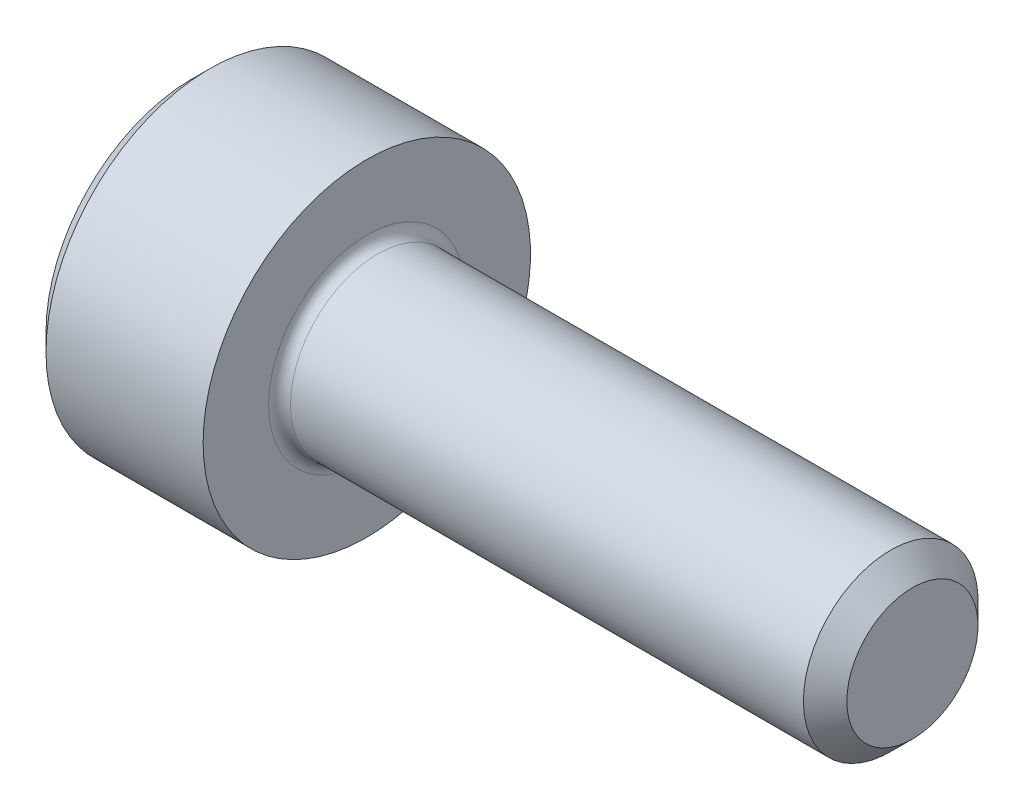
ISO-10303-21;
HEADER;
FILE_DESCRIPTION(('STEP AP214'),'2;1');
FILE_NAME('part.step','',(''),(''),'','','');
FILE_SCHEMA(('AUTOMOTIVE_DESIGN { 1 0 10303 214 1 1 1 1 }'));
ENDSEC;
DATA;
#1=APPLICATION_CONTEXT('core data for automotive mechanical design processes');
#2=APPLICATION_PROTOCOL_DEFINITION('international standard','automotive_design',2000,#1);
#3=PRODUCT_CONTEXT('',#1,'mechanical');
#4=PRODUCT('Part','Part','',(#3));
#5=PRODUCT_RELATED_PRODUCT_CATEGORY('part','',(#4));
#6=PRODUCT_DEFINITION_FORMATION('','',#4);
#7=PRODUCT_DEFINITION_CONTEXT('part definition',#1,'design');
#8=PRODUCT_DEFINITION('design','',#6,#7);
#9=PRODUCT_DEFINITION_SHAPE('','',#8);
#10=(LENGTH_UNIT() NAMED_UNIT(*) SI_UNIT(.MILLI.,.METRE.));
#11=(NAMED_UNIT(*) PLANE_ANGLE_UNIT() SI_UNIT($,.RADIAN.));
#12=(NAMED_UNIT(*) SI_UNIT($,.STERADIAN.) SOLID_ANGLE_UNIT());
#13=UNCERTAINTY_MEASURE_WITH_UNIT(LENGTH_MEASURE(1.E-05),#10,'distance_accuracy_value','');
#14=(GEOMETRIC_REPRESENTATION_CONTEXT(3) GLOBAL_UNCERTAINTY_ASSIGNED_CONTEXT((#13)) GLOBAL_UNIT_ASSIGNED_CONTEXT((#10,
#11,#12)) REPRESENTATION_CONTEXT('',''));
#15=CARTESIAN_POINT('',(0.,0.,0.));
#16=DIRECTION('',(0.,0.,1.));
#17=DIRECTION('',(1.,0.,0.));
#18=AXIS2_PLACEMENT_3D('',#15,#16,#17);
#19=CARTESIAN_POINT('',(-55.965423383529,9.55422118909155,-1.7600651401608));
#20=DIRECTION('',(-1.,0.,0.));
#21=DIRECTION('',(0.,0.,1.));
#22=AXIS2_PLACEMENT_3D('',#19,#20,#21);
#23=PLANE('',#22);
#24=DIRECTION('',(0.,-0.5,0.866025403784438));
#25=VECTOR('',#24,1.);
#26=CARTESIAN_POINT('',(-55.965423383529,10.4462273549895,-1.76006514016081));
#27=LINE('',#26,#25);
#28=CARTESIAN_POINT('',(-55.965423383529,10.4462273549895,-1.76006514016081));
#29=VERTEX_POINT('',#28);
#30=CARTESIAN_POINT('',(-55.965423383529,10.0002242720405,-0.987565140160805));
#31=VERTEX_POINT('',#30);
#32=EDGE_CURVE('E422',#29,#31,#27,.T.);
#33=ORIENTED_EDGE('',*,*,#32,.T.);
#34=DIRECTION('',(0.,1.,0.));
#35=VECTOR('',#34,1.);
#36=CARTESIAN_POINT('',(-55.965423383529,9.10821810614256,-0.987565140160804));
#37=LINE('',#36,#35);
#38=CARTESIAN_POINT('',(-55.965423383529,9.10821810614256,-0.987565140160804));
#39=VERTEX_POINT('',#38);
#40=EDGE_CURVE('E112',#39,#31,#37,.T.);
#41=ORIENTED_EDGE('',*,*,#40,.F.);
#42=DIRECTION('',(0.,-0.500000000000001,-0.866025403784438));
#43=VECTOR('',#42,1.);
#44=CARTESIAN_POINT('',(-55.965423383529,9.10821810614256,-0.987565140160804));
#45=LINE('',#44,#43);
#46=CARTESIAN_POINT('',(-55.965423383529,8.66221502319358,-1.7600651401608));
#47=VERTEX_POINT('',#46);
#48=EDGE_CURVE('E425',#39,#47,#45,.T.);
#49=ORIENTED_EDGE('',*,*,#48,.T.);
#50=DIRECTION('',(0.,0.500000000000001,-0.866025403784438));
#51=VECTOR('',#50,1.);
#52=CARTESIAN_POINT('',(-55.965423383529,8.66221502319358,-1.7600651401608));
#53=LINE('',#52,#51);
#54=CARTESIAN_POINT('',(-55.965423383529,9.10821810614256,-2.5325651401608));
#55=VERTEX_POINT('',#54);
#56=EDGE_CURVE('E428',#47,#55,#53,.T.);
#57=ORIENTED_EDGE('',*,*,#56,.T.);
#58=DIRECTION('',(0.,-1.,0.));
#59=VECTOR('',#58,1.);
#60=CARTESIAN_POINT('',(-55.965423383529,10.0002242720405,-2.5325651401608));
#61=LINE('',#60,#59);
#62=CARTESIAN_POINT('',(-55.965423383529,10.0002242720405,-2.5325651401608));
#63=VERTEX_POINT('',#62);
#64=EDGE_CURVE('E431',#63,#55,#61,.T.);
#65=ORIENTED_EDGE('',*,*,#64,.F.);
#66=DIRECTION('',(0.,-0.500000000000001,-0.866025403784438));
#67=VECTOR('',#66,1.);
#68=CARTESIAN_POINT('',(-55.965423383529,10.4462273549895,-1.76006514016081));
#69=LINE('',#68,#67);
#70=EDGE_CURVE('E107',#29,#63,#69,.T.);
#71=ORIENTED_EDGE('',*,*,#70,.F.);
#72=EDGE_LOOP('',(#33,#41,#49,#57,#65,#71));
#73=FACE_BOUND('',#72,.T.);
#74=CARTESIAN_POINT('',(-55.965423383529,9.55422118909155,-1.7600651401608));
#75=DIRECTION('',(-1.,0.,0.));
#76=DIRECTION('',(0.,0.,1.));
#77=AXIS2_PLACEMENT_3D('',#74,#75,#76);
#78=CIRCLE('',#77,1.34);
#79=CARTESIAN_POINT('',(-55.965423383529,9.55422118909155,-0.420065140160804));
#80=VERTEX_POINT('',#79);
#81=EDGE_CURVE('E123',#80,#80,#78,.T.);
#82=ORIENTED_EDGE('',*,*,#81,.T.);
#83=EDGE_LOOP('',(#82));
#84=FACE_BOUND('',#83,.T.);
#85=ADVANCED_FACE('F16',(#73,#84),#23,.T.);
#86=CARTESIAN_POINT('',(-49.365423383529,10.1552211890916,-1.7600651401608));
#87=DIRECTION('',(1.,0.,0.));
#88=DIRECTION('',(0.,0.,-1.));
#89=AXIS2_PLACEMENT_3D('',#86,#87,#88);
#90=PLANE('',#89);
#91=CARTESIAN_POINT('',(-49.365423383529,9.55422118909155,-1.7600651401608));
#92=DIRECTION('',(-1.,0.,0.));
#93=DIRECTION('',(0.,0.,1.));
#94=AXIS2_PLACEMENT_3D('',#91,#92,#93);
#95=CIRCLE('',#94,0.601);
#96=CARTESIAN_POINT('',(-49.365423383529,9.55422118909155,-1.1590651401608));
#97=VERTEX_POINT('',#96);
#98=EDGE_CURVE('E136',#97,#97,#95,.T.);
#99=ORIENTED_EDGE('',*,*,#98,.F.);
#100=EDGE_LOOP('',(#99));
#101=FACE_BOUND('',#100,.T.);
#102=ADVANCED_FACE('F158',(#101),#90,.T.);
#103=CARTESIAN_POINT('',(-49.365423383529,9.55422118909155,-1.7600651401608));
#104=DIRECTION('',(-1.,0.,0.));
#105=DIRECTION('',(0.,0.,1.));
#106=AXIS2_PLACEMENT_3D('',#103,#104,#105);
#107=CONICAL_SURFACE('',#106,0.601,0.785398163397472);
#108=CARTESIAN_POINT('',(-49.564423383529,9.55422118909155,-1.7600651401608));
#109=DIRECTION('',(-1.,0.,0.));
#110=DIRECTION('',(0.,0.,1.));
#111=AXIS2_PLACEMENT_3D('',#108,#109,#110);
#112=CIRCLE('',#111,0.8);
#113=CARTESIAN_POINT('',(-49.564423383529,9.55422118909155,-0.960065140160804));
#114=VERTEX_POINT('',#113);
#115=EDGE_CURVE('E133',#114,#114,#112,.T.);
#116=ORIENTED_EDGE('',*,*,#115,.F.);
#117=EDGE_LOOP('',(#116));
#118=FACE_BOUND('',#117,.T.);
#119=ORIENTED_EDGE('',*,*,#98,.T.);
#120=EDGE_LOOP('',(#119));
#121=FACE_BOUND('',#120,.T.);
#122=ADVANCED_FACE('F164',(#118,#121),#107,.T.);
#123=CARTESIAN_POINT('',(-87.715423383529,9.55422118909155,-1.7600651401608));
#124=DIRECTION('',(-1.,0.,0.));
#125=DIRECTION('',(0.,0.,1.));
#126=AXIS2_PLACEMENT_3D('',#123,#124,#125);
#127=CYLINDRICAL_SURFACE('',#126,0.799999999999999);
#128=CARTESIAN_POINT('',(-54.265423383529,9.55422118909155,-1.7600651401608));
#129=DIRECTION('',(1.,0.,0.));
#130=DIRECTION('',(0.,0.,-1.));
#131=AXIS2_PLACEMENT_3D('',#128,#129,#130);
#132=CIRCLE('',#131,0.799999999999999);
#133=CARTESIAN_POINT('',(-54.265423383529,9.55422118909155,-2.5600651401608));
#134=VERTEX_POINT('',#133);
#135=EDGE_CURVE('E10',#134,#134,#132,.T.);
#136=ORIENTED_EDGE('',*,*,#135,.T.);
#137=EDGE_LOOP('',(#136));
#138=FACE_BOUND('',#137,.T.);
#139=ORIENTED_EDGE('',*,*,#115,.T.);
#140=EDGE_LOOP('',(#139));
#141=FACE_BOUND('',#140,.T.);
#142=ADVANCED_FACE('F175',(#138,#141),#127,.T.);
#143=CARTESIAN_POINT('',(-54.365423383529,11.0542211890915,-1.7600651401608));
#144=DIRECTION('',(1.,0.,0.));
#145=DIRECTION('',(0.,0.,-1.));
#146=AXIS2_PLACEMENT_3D('',#143,#144,#145);
#147=PLANE('',#146);
#148=CARTESIAN_POINT('',(-54.365423383529,9.55422118909155,-1.7600651401608));
#149=DIRECTION('',(1.,0.,0.));
#150=DIRECTION('',(0.,0.,-1.));
#151=AXIS2_PLACEMENT_3D('',#148,#149,#150);
#152=CIRCLE('',#151,0.9);
#153=CARTESIAN_POINT('',(-54.365423383529,9.55422118909155,-2.6600651401608));
#154=VERTEX_POINT('',#153);
#155=EDGE_CURVE('E24',#154,#154,#152,.F.);
#156=ORIENTED_EDGE('',*,*,#155,.T.);
#157=EDGE_LOOP('',(#156));
#158=FACE_BOUND('',#157,.T.);
#159=CARTESIAN_POINT('',(-54.365423383529,9.55422118909155,-1.7600651401608));
#160=DIRECTION('',(-1.,0.,0.));
#161=DIRECTION('',(0.,0.,1.));
#162=AXIS2_PLACEMENT_3D('',#159,#160,#161);
#163=CIRCLE('',#162,1.5);
#164=CARTESIAN_POINT('',(-54.365423383529,9.55422118909155,-0.260065140160805));
#165=VERTEX_POINT('',#164);
#166=EDGE_CURVE('E130',#165,#165,#163,.T.);
#167=ORIENTED_EDGE('',*,*,#166,.F.);
#168=EDGE_LOOP('',(#167));
#169=FACE_BOUND('',#168,.T.);
#170=ADVANCED_FACE('F141',(#158,#169),#147,.T.);
#171=CARTESIAN_POINT('',(-87.715423383529,9.55422118909155,-1.7600651401608));
#172=DIRECTION('',(-1.,0.,0.));
#173=DIRECTION('',(0.,0.,1.));
#174=AXIS2_PLACEMENT_3D('',#171,#172,#173);
#175=CYLINDRICAL_SURFACE('',#174,1.5);
#176=ORIENTED_EDGE('',*,*,#166,.T.);
#177=EDGE_LOOP('',(#176));
#178=FACE_BOUND('',#177,.T.);
#179=CARTESIAN_POINT('',(-55.805423383529,9.55422118909155,-1.7600651401608));
#180=DIRECTION('',(-1.,0.,0.));
#181=DIRECTION('',(0.,0.,1.));
#182=AXIS2_PLACEMENT_3D('',#179,#180,#181);
#183=CIRCLE('',#182,1.5);
#184=CARTESIAN_POINT('',(-55.805423383529,9.55422118909155,-0.260065140160805));
#185=VERTEX_POINT('',#184);
#186=EDGE_CURVE('E127',#185,#185,#183,.T.);
#187=ORIENTED_EDGE('',*,*,#186,.F.);
#188=EDGE_LOOP('',(#187));
#189=FACE_BOUND('',#188,.T.);
#190=ADVANCED_FACE('F153',(#178,#189),#175,.T.);
#191=CARTESIAN_POINT('',(-55.965423383529,9.55422118909155,-1.7600651401608));
#192=DIRECTION('',(1.,0.,0.));
#193=DIRECTION('',(0.,0.,-1.));
#194=AXIS2_PLACEMENT_3D('',#191,#192,#193);
#195=CONICAL_SURFACE('',#194,1.34,0.785398163397443);
#196=ORIENTED_EDGE('',*,*,#186,.T.);
#197=EDGE_LOOP('',(#196));
#198=FACE_BOUND('',#197,.T.);
#199=ORIENTED_EDGE('',*,*,#81,.F.);
#200=EDGE_LOOP('',(#199));
#201=FACE_BOUND('',#200,.T.);
#202=ADVANCED_FACE('F145',(#198,#201),#195,.T.);
#203=CARTESIAN_POINT('',(-54.265423383529,9.55422118909155,-1.7600651401608));
#204=DIRECTION('',(1.,0.,0.));
#205=DIRECTION('',(0.,0.,-1.));
#206=AXIS2_PLACEMENT_3D('',#203,#204,#205);
#207=TOROIDAL_SURFACE('',#206,0.9,0.1);
#208=ORIENTED_EDGE('',*,*,#135,.F.);
#209=EDGE_LOOP('',(#208));
#210=FACE_BOUND('',#209,.T.);
#211=ORIENTED_EDGE('',*,*,#155,.F.);
#212=EDGE_LOOP('',(#211));
#213=FACE_BOUND('',#212,.T.);
#214=ADVANCED_FACE('F18',(#210,#213),#207,.F.);
#215=CARTESIAN_POINT('',(-55.265423383529,10.4462273549895,-1.76006514016081));
#216=DIRECTION('',(0.,-0.866025403784438,-0.5));
#217=DIRECTION('',(0.,0.5,-0.866025403784439));
#218=AXIS2_PLACEMENT_3D('',#215,#216,#217);
#219=PLANE('',#218);
#220=ORIENTED_EDGE('',*,*,#32,.F.);
#221=DIRECTION('',(-1.,0.,0.));
#222=VECTOR('',#221,1.);
#223=CARTESIAN_POINT('',(-55.265423383529,10.4462273549895,-1.76006514016081));
#224=LINE('',#223,#222);
#225=CARTESIAN_POINT('',(-55.265423383529,10.4462273549895,-1.76006514016081));
#226=VERTEX_POINT('',#225);
#227=EDGE_CURVE('E421',#226,#29,#224,.T.);
#228=ORIENTED_EDGE('',*,*,#227,.F.);
#229=DIRECTION('',(0.,-0.5,0.866025403784438));
#230=VECTOR('',#229,1.);
#231=CARTESIAN_POINT('',(-55.265423383529,10.4462273549895,-1.76006514016081));
#232=LINE('',#231,#230);
#233=CARTESIAN_POINT('',(-55.265423383529,10.223225813515,-1.3738151401608));
#234=VERTEX_POINT('',#233);
#235=EDGE_CURVE('E99',#226,#234,#232,.T.);
#236=ORIENTED_EDGE('',*,*,#235,.T.);
#237=CARTESIAN_POINT('',(-55.265423383529,10.0002242720405,-0.987565140160805));
#238=VERTEX_POINT('',#237);
#239=EDGE_CURVE('E90',#234,#238,#232,.T.);
#240=ORIENTED_EDGE('',*,*,#239,.T.);
#241=DIRECTION('',(-1.,0.,0.));
#242=VECTOR('',#241,1.);
#243=CARTESIAN_POINT('',(-55.265423383529,10.0002242720405,-0.987565140160805));
#244=LINE('',#243,#242);
#245=EDGE_CURVE('E104',#238,#31,#244,.T.);
#246=ORIENTED_EDGE('',*,*,#245,.T.);
#247=EDGE_LOOP('',(#220,#228,#236,#240,#246));
#248=FACE_BOUND('',#247,.T.);
#249=ADVANCED_FACE('F103',(#248),#219,.T.);
#250=CARTESIAN_POINT('',(-55.265423383529,9.10821810614256,-0.987565140160804));
#251=DIRECTION('',(0.,0.,1.));
#252=DIRECTION('',(0.,-1.,0.));
#253=AXIS2_PLACEMENT_3D('',#250,#251,#252);
#254=PLANE('',#253);
#255=ORIENTED_EDGE('',*,*,#40,.T.);
#256=ORIENTED_EDGE('',*,*,#245,.F.);
#257=DIRECTION('',(0.,1.,0.));
#258=VECTOR('',#257,1.);
#259=CARTESIAN_POINT('',(-55.265423383529,9.10821810614256,-0.987565140160804));
#260=LINE('',#259,#258);
#261=CARTESIAN_POINT('',(-55.265423383529,9.55422118909155,-0.987565140160805));
#262=VERTEX_POINT('',#261);
#263=EDGE_CURVE('E87',#262,#238,#260,.T.);
#264=ORIENTED_EDGE('',*,*,#263,.F.);
#265=CARTESIAN_POINT('',(-55.265423383529,9.10821810614256,-0.987565140160804));
#266=VERTEX_POINT('',#265);
#267=EDGE_CURVE('E98',#266,#262,#260,.T.);
#268=ORIENTED_EDGE('',*,*,#267,.F.);
#269=DIRECTION('',(-1.,0.,0.));
#270=VECTOR('',#269,1.);
#271=CARTESIAN_POINT('',(-55.265423383529,9.10821810614256,-0.987565140160804));
#272=LINE('',#271,#270);
#273=EDGE_CURVE('E114',#266,#39,#272,.T.);
#274=ORIENTED_EDGE('',*,*,#273,.T.);
#275=EDGE_LOOP('',(#255,#256,#264,#268,#274));
#276=FACE_BOUND('',#275,.T.);
#277=ADVANCED_FACE('F109',(#276),#254,.F.);
#278=CARTESIAN_POINT('',(-55.265423383529,9.10821810614256,-0.987565140160804));
#279=DIRECTION('',(0.,0.866025403784438,-0.500000000000001));
#280=DIRECTION('',(0.,0.500000000000001,0.866025403784438));
#281=AXIS2_PLACEMENT_3D('',#278,#279,#280);
#282=PLANE('',#281);
#283=ORIENTED_EDGE('',*,*,#48,.F.);
#284=ORIENTED_EDGE('',*,*,#273,.F.);
#285=DIRECTION('',(0.,-0.500000000000001,-0.866025403784438));
#286=VECTOR('',#285,1.);
#287=CARTESIAN_POINT('',(-55.265423383529,9.10821810614256,-0.987565140160804));
#288=LINE('',#287,#286);
#289=CARTESIAN_POINT('',(-55.265423383529,8.88521656466807,-1.3738151401608));
#290=VERTEX_POINT('',#289);
#291=EDGE_CURVE('E402',#266,#290,#288,.T.);
#292=ORIENTED_EDGE('',*,*,#291,.T.);
#293=CARTESIAN_POINT('',(-55.265423383529,8.66221502319358,-1.7600651401608));
#294=VERTEX_POINT('',#293);
#295=EDGE_CURVE('E404',#290,#294,#288,.T.);
#296=ORIENTED_EDGE('',*,*,#295,.T.);
#297=DIRECTION('',(-1.,0.,0.));
#298=VECTOR('',#297,1.);
#299=CARTESIAN_POINT('',(-55.265423383529,8.66221502319358,-1.7600651401608));
#300=LINE('',#299,#298);
#301=EDGE_CURVE('E119',#294,#47,#300,.T.);
#302=ORIENTED_EDGE('',*,*,#301,.T.);
#303=EDGE_LOOP('',(#283,#284,#292,#296,#302));
#304=FACE_BOUND('',#303,.T.);
#305=ADVANCED_FACE('F232',(#304),#282,.T.);
#306=CARTESIAN_POINT('',(-55.265423383529,8.66221502319358,-1.7600651401608));
#307=DIRECTION('',(0.,0.866025403784438,0.500000000000001));
#308=DIRECTION('',(0.,-0.500000000000001,0.866025403784438));
#309=AXIS2_PLACEMENT_3D('',#306,#307,#308);
#310=PLANE('',#309);
#311=ORIENTED_EDGE('',*,*,#56,.F.);
#312=ORIENTED_EDGE('',*,*,#301,.F.);
#313=DIRECTION('',(0.,0.500000000000001,-0.866025403784438));
#314=VECTOR('',#313,1.);
#315=CARTESIAN_POINT('',(-55.265423383529,8.66221502319358,-1.7600651401608));
#316=LINE('',#315,#314);
#317=CARTESIAN_POINT('',(-55.265423383529,8.88521656466807,-2.14631514016081));
#318=VERTEX_POINT('',#317);
#319=EDGE_CURVE('E407',#294,#318,#316,.T.);
#320=ORIENTED_EDGE('',*,*,#319,.T.);
#321=CARTESIAN_POINT('',(-55.265423383529,9.10821810614256,-2.5325651401608));
#322=VERTEX_POINT('',#321);
#323=EDGE_CURVE('E411',#318,#322,#316,.T.);
#324=ORIENTED_EDGE('',*,*,#323,.T.);
#325=DIRECTION('',(-1.,0.,0.));
#326=VECTOR('',#325,1.);
#327=CARTESIAN_POINT('',(-55.265423383529,9.10821810614256,-2.5325651401608));
#328=LINE('',#327,#326);
#329=EDGE_CURVE('E440',#322,#55,#328,.T.);
#330=ORIENTED_EDGE('',*,*,#329,.T.);
#331=EDGE_LOOP('',(#311,#312,#320,#324,#330));
#332=FACE_BOUND('',#331,.T.);
#333=ADVANCED_FACE('F242',(#332),#310,.T.);
#334=CARTESIAN_POINT('',(-55.265423383529,10.0002242720405,-2.5325651401608));
#335=DIRECTION('',(0.,0.,-1.));
#336=DIRECTION('',(0.,1.,0.));
#337=AXIS2_PLACEMENT_3D('',#334,#335,#336);
#338=PLANE('',#337);
#339=ORIENTED_EDGE('',*,*,#64,.T.);
#340=ORIENTED_EDGE('',*,*,#329,.F.);
#341=DIRECTION('',(0.,-1.,0.));
#342=VECTOR('',#341,1.);
#343=CARTESIAN_POINT('',(-55.265423383529,10.0002242720405,-2.5325651401608));
#344=LINE('',#343,#342);
#345=CARTESIAN_POINT('',(-55.265423383529,9.55422118909155,-2.5325651401608));
#346=VERTEX_POINT('',#345);
#347=EDGE_CURVE('E415',#346,#322,#344,.T.);
#348=ORIENTED_EDGE('',*,*,#347,.F.);
#349=CARTESIAN_POINT('',(-55.265423383529,10.0002242720405,-2.5325651401608));
#350=VERTEX_POINT('',#349);
#351=EDGE_CURVE('E31',#350,#346,#344,.T.);
#352=ORIENTED_EDGE('',*,*,#351,.F.);
#353=DIRECTION('',(-1.,0.,0.));
#354=VECTOR('',#353,1.);
#355=CARTESIAN_POINT('',(-55.265423383529,10.0002242720405,-2.5325651401608));
#356=LINE('',#355,#354);
#357=EDGE_CURVE('E437',#350,#63,#356,.T.);
#358=ORIENTED_EDGE('',*,*,#357,.T.);
#359=EDGE_LOOP('',(#339,#340,#348,#352,#358));
#360=FACE_BOUND('',#359,.T.);
#361=ADVANCED_FACE('F253',(#360),#338,.F.);
#362=CARTESIAN_POINT('',(-55.265423383529,10.4462273549895,-1.76006514016081));
#363=DIRECTION('',(0.,0.866025403784438,-0.500000000000001));
#364=DIRECTION('',(0.,0.500000000000001,0.866025403784438));
#365=AXIS2_PLACEMENT_3D('',#362,#363,#364);
#366=PLANE('',#365);
#367=ORIENTED_EDGE('',*,*,#70,.T.);
#368=ORIENTED_EDGE('',*,*,#357,.F.);
#369=DIRECTION('',(0.,-0.500000000000001,-0.866025403784438));
#370=VECTOR('',#369,1.);
#371=CARTESIAN_POINT('',(-55.265423383529,10.4462273549895,-1.76006514016081));
#372=LINE('',#371,#370);
#373=CARTESIAN_POINT('',(-55.265423383529,10.223225813515,-2.14631514016081));
#374=VERTEX_POINT('',#373);
#375=EDGE_CURVE('E417',#374,#350,#372,.T.);
#376=ORIENTED_EDGE('',*,*,#375,.F.);
#377=EDGE_CURVE('E418',#226,#374,#372,.T.);
#378=ORIENTED_EDGE('',*,*,#377,.F.);
#379=ORIENTED_EDGE('',*,*,#227,.T.);
#380=EDGE_LOOP('',(#367,#368,#376,#378,#379));
#381=FACE_BOUND('',#380,.T.);
#382=ADVANCED_FACE('F264',(#381),#366,.F.);
#383=CARTESIAN_POINT('',(-55.265423383529,9.55422118909155,-0.215065140160806));
#384=DIRECTION('',(1.,0.,0.));
#385=DIRECTION('',(0.,0.,-1.));
#386=AXIS2_PLACEMENT_3D('',#383,#384,#385);
#387=PLANE('',#386);
#388=ORIENTED_EDGE('',*,*,#347,.T.);
#389=ORIENTED_EDGE('',*,*,#323,.F.);
#390=CARTESIAN_POINT('',(-55.265423383529,9.55422118909155,-1.7600651401608));
#391=DIRECTION('',(-1.,0.,0.));
#392=DIRECTION('',(0.,0.,1.));
#393=AXIS2_PLACEMENT_3D('',#390,#391,#392);
#394=CIRCLE('',#393,0.772499999999997);
#395=EDGE_CURVE('E447',#346,#318,#394,.T.);
#396=ORIENTED_EDGE('',*,*,#395,.F.);
#397=EDGE_LOOP('',(#388,#389,#396));
#398=FACE_BOUND('',#397,.T.);
#399=ADVANCED_FACE('F275',(#398),#387,.F.);
#400=ORIENTED_EDGE('',*,*,#319,.F.);
#401=ORIENTED_EDGE('',*,*,#295,.F.);
#402=EDGE_CURVE('E117',#318,#290,#394,.T.);
#403=ORIENTED_EDGE('',*,*,#402,.F.);
#404=EDGE_LOOP('',(#400,#401,#403));
#405=FACE_BOUND('',#404,.T.);
#406=ADVANCED_FACE('F286',(#405),#387,.F.);
#407=ORIENTED_EDGE('',*,*,#291,.F.);
#408=ORIENTED_EDGE('',*,*,#267,.T.);
#409=EDGE_CURVE('E113',#290,#262,#394,.T.);
#410=ORIENTED_EDGE('',*,*,#409,.F.);
#411=EDGE_LOOP('',(#407,#408,#410));
#412=FACE_BOUND('',#411,.T.);
#413=ADVANCED_FACE('F298',(#412),#387,.F.);
#414=ORIENTED_EDGE('',*,*,#263,.T.);
#415=ORIENTED_EDGE('',*,*,#239,.F.);
#416=EDGE_CURVE('E93',#262,#234,#394,.T.);
#417=ORIENTED_EDGE('',*,*,#416,.F.);
#418=EDGE_LOOP('',(#414,#415,#417));
#419=FACE_BOUND('',#418,.T.);
#420=ADVANCED_FACE('F89',(#419),#387,.F.);
#421=ORIENTED_EDGE('',*,*,#235,.F.);
#422=ORIENTED_EDGE('',*,*,#377,.T.);
#423=EDGE_CURVE('E124',#234,#374,#394,.T.);
#424=ORIENTED_EDGE('',*,*,#423,.F.);
#425=EDGE_LOOP('',(#421,#422,#424));
#426=FACE_BOUND('',#425,.T.);
#427=ADVANCED_FACE('F317',(#426),#387,.F.);
#428=ORIENTED_EDGE('',*,*,#375,.T.);
#429=ORIENTED_EDGE('',*,*,#351,.T.);
#430=EDGE_CURVE('E446',#374,#346,#394,.T.);
#431=ORIENTED_EDGE('',*,*,#430,.F.);
#432=EDGE_LOOP('',(#428,#429,#431));
#433=FACE_BOUND('',#432,.T.);
#434=ADVANCED_FACE('F289',(#433),#387,.F.);
#435=CARTESIAN_POINT('',(-55.265423383529,9.55422118909155,-1.7600651401608));
#436=DIRECTION('',(-1.,0.,0.));
#437=DIRECTION('',(0.,0.,1.));
#438=AXIS2_PLACEMENT_3D('',#435,#436,#437);
#439=CONICAL_SURFACE('',#438,0.772499999999997,1.04719755119659);
#440=CARTESIAN_POINT('',(-54.81942030058,9.55422118909155,-1.7600651401608));
#441=VERTEX_POINT('',#440);
#442=VERTEX_LOOP('',#441);
#443=FACE_BOUND('',#442,.T.);
#444=ORIENTED_EDGE('',*,*,#416,.T.);
#445=ORIENTED_EDGE('',*,*,#423,.T.);
#446=ORIENTED_EDGE('',*,*,#430,.T.);
#447=ORIENTED_EDGE('',*,*,#395,.T.);
#448=ORIENTED_EDGE('',*,*,#402,.T.);
#449=ORIENTED_EDGE('',*,*,#409,.T.);
#450=EDGE_LOOP('',(#444,#445,#446,#447,#448,#449));
#451=FACE_BOUND('',#450,.T.);
#452=ADVANCED_FACE('F168',(#443,#451),#439,.F.);
#453=CLOSED_SHELL('',(#85,#102,#122,#142,#170,#190,#202,#214,#249,#277,#305,#333,#361,#382,#399,
#406,#413,#420,#427,#434,#452));
#454=MANIFOLD_SOLID_BREP('B1',#453);
#455=ADVANCED_BREP_SHAPE_REPRESENTATION('',(#18,#454),#14);
#456=SHAPE_DEFINITION_REPRESENTATION(#9,#455);
ENDSEC;
END-ISO-10303-21;
